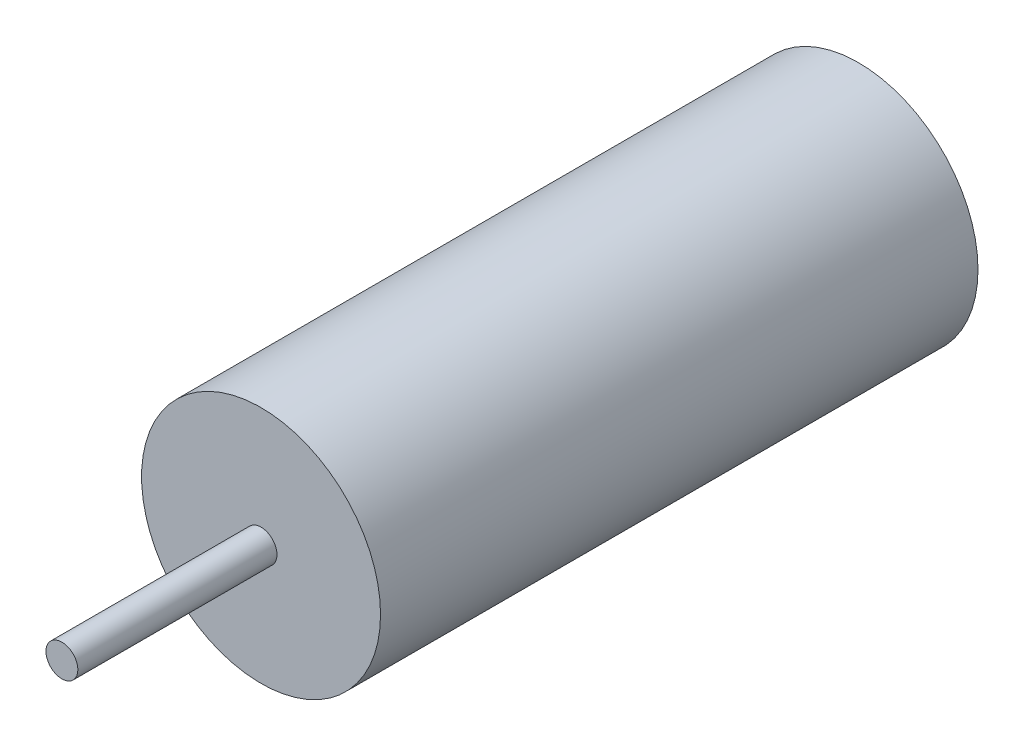
ISO-10303-21;
HEADER;
FILE_DESCRIPTION(('STEP AP214'),'2;1');
FILE_NAME('part.step','',(''),(''),'','','');
FILE_SCHEMA(('AUTOMOTIVE_DESIGN { 1 0 10303 214 1 1 1 1 }'));
ENDSEC;
DATA;
#1=APPLICATION_CONTEXT('core data for automotive mechanical design processes');
#2=APPLICATION_PROTOCOL_DEFINITION('international standard','automotive_design',2000,#1);
#3=PRODUCT_CONTEXT('',#1,'mechanical');
#4=PRODUCT('Part','Part','',(#3));
#5=PRODUCT_RELATED_PRODUCT_CATEGORY('part','',(#4));
#6=PRODUCT_DEFINITION_FORMATION('','',#4);
#7=PRODUCT_DEFINITION_CONTEXT('part definition',#1,'design');
#8=PRODUCT_DEFINITION('design','',#6,#7);
#9=PRODUCT_DEFINITION_SHAPE('','',#8);
#10=(LENGTH_UNIT() NAMED_UNIT(*) SI_UNIT(.MILLI.,.METRE.));
#11=(NAMED_UNIT(*) PLANE_ANGLE_UNIT() SI_UNIT($,.RADIAN.));
#12=(NAMED_UNIT(*) SI_UNIT($,.STERADIAN.) SOLID_ANGLE_UNIT());
#13=UNCERTAINTY_MEASURE_WITH_UNIT(LENGTH_MEASURE(1.E-05),#10,'distance_accuracy_value','');
#14=(GEOMETRIC_REPRESENTATION_CONTEXT(3) GLOBAL_UNCERTAINTY_ASSIGNED_CONTEXT((#13)) GLOBAL_UNIT_ASSIGNED_CONTEXT((#10,
#11,#12)) REPRESENTATION_CONTEXT('',''));
#15=CARTESIAN_POINT('',(0.,0.,0.));
#16=DIRECTION('',(0.,0.,1.));
#17=DIRECTION('',(1.,0.,0.));
#18=AXIS2_PLACEMENT_3D('',#15,#16,#17);
#19=CARTESIAN_POINT('',(0.,0.,15.));
#20=DIRECTION('',(0.,0.,-1.));
#21=DIRECTION('',(-1.,0.,0.));
#22=AXIS2_PLACEMENT_3D('',#19,#20,#21);
#23=CYLINDRICAL_SURFACE('',#22,3.);
#24=CARTESIAN_POINT('',(0.,0.,15.));
#25=DIRECTION('',(0.,0.,1.));
#26=DIRECTION('',(1.,0.,0.));
#27=AXIS2_PLACEMENT_3D('',#24,#25,#26);
#28=CIRCLE('',#27,3.);
#29=CARTESIAN_POINT('',(3.,0.,15.));
#30=VERTEX_POINT('',#29);
#31=EDGE_CURVE('E10',#30,#30,#28,.T.);
#32=ORIENTED_EDGE('',*,*,#31,.F.);
#33=EDGE_LOOP('',(#32));
#34=FACE_BOUND('',#33,.T.);
#35=CARTESIAN_POINT('',(0.,0.,0.));
#36=DIRECTION('',(0.,0.,1.));
#37=DIRECTION('',(1.,0.,0.));
#38=AXIS2_PLACEMENT_3D('',#35,#36,#37);
#39=CIRCLE('',#38,3.);
#40=CARTESIAN_POINT('',(3.,0.,0.));
#41=VERTEX_POINT('',#40);
#42=EDGE_CURVE('E40',#41,#41,#39,.T.);
#43=ORIENTED_EDGE('',*,*,#42,.T.);
#44=EDGE_LOOP('',(#43));
#45=FACE_BOUND('',#44,.T.);
#46=ADVANCED_FACE('F37',(#34,#45),#23,.T.);
#47=CARTESIAN_POINT('',(0.,0.,15.));
#48=DIRECTION('',(0.,0.,1.));
#49=DIRECTION('',(1.,0.,0.));
#50=AXIS2_PLACEMENT_3D('',#47,#48,#49);
#51=PLANE('',#50);
#52=CARTESIAN_POINT('',(0.,0.,15.));
#53=DIRECTION('',(0.,0.,1.));
#54=DIRECTION('',(1.,0.,0.));
#55=AXIS2_PLACEMENT_3D('',#52,#53,#54);
#56=CIRCLE('',#55,0.4);
#57=CARTESIAN_POINT('',(0.4,0.,15.));
#58=VERTEX_POINT('',#57);
#59=EDGE_CURVE('E49',#58,#58,#56,.T.);
#60=ORIENTED_EDGE('',*,*,#59,.F.);
#61=EDGE_LOOP('',(#60));
#62=FACE_BOUND('',#61,.T.);
#63=ORIENTED_EDGE('',*,*,#31,.T.);
#64=EDGE_LOOP('',(#63));
#65=FACE_BOUND('',#64,.T.);
#66=ADVANCED_FACE('F64',(#62,#65),#51,.T.);
#67=CARTESIAN_POINT('',(0.,0.,0.));
#68=DIRECTION('',(0.,0.,1.));
#69=DIRECTION('',(1.,0.,0.));
#70=AXIS2_PLACEMENT_3D('',#67,#68,#69);
#71=PLANE('',#70);
#72=ORIENTED_EDGE('',*,*,#42,.F.);
#73=EDGE_LOOP('',(#72));
#74=FACE_BOUND('',#73,.T.);
#75=ADVANCED_FACE('F60',(#74),#71,.F.);
#76=CARTESIAN_POINT('',(0.,0.,20.));
#77=DIRECTION('',(0.,0.,-1.));
#78=DIRECTION('',(-1.,0.,0.));
#79=AXIS2_PLACEMENT_3D('',#76,#77,#78);
#80=CYLINDRICAL_SURFACE('',#79,0.4);
#81=CARTESIAN_POINT('',(0.,0.,20.));
#82=DIRECTION('',(0.,0.,1.));
#83=DIRECTION('',(1.,0.,0.));
#84=AXIS2_PLACEMENT_3D('',#81,#82,#83);
#85=CIRCLE('',#84,0.4);
#86=CARTESIAN_POINT('',(0.4,0.,20.));
#87=VERTEX_POINT('',#86);
#88=EDGE_CURVE('E47',#87,#87,#85,.T.);
#89=ORIENTED_EDGE('',*,*,#88,.F.);
#90=EDGE_LOOP('',(#89));
#91=FACE_BOUND('',#90,.T.);
#92=ORIENTED_EDGE('',*,*,#59,.T.);
#93=EDGE_LOOP('',(#92));
#94=FACE_BOUND('',#93,.T.);
#95=ADVANCED_FACE('F57',(#91,#94),#80,.T.);
#96=CARTESIAN_POINT('',(0.,0.,20.));
#97=DIRECTION('',(0.,0.,1.));
#98=DIRECTION('',(1.,0.,0.));
#99=AXIS2_PLACEMENT_3D('',#96,#97,#98);
#100=PLANE('',#99);
#101=ORIENTED_EDGE('',*,*,#88,.T.);
#102=EDGE_LOOP('',(#101));
#103=FACE_BOUND('',#102,.T.);
#104=ADVANCED_FACE('F55',(#103),#100,.T.);
#105=CLOSED_SHELL('',(#46,#66,#75,#95,#104));
#106=MANIFOLD_SOLID_BREP('B2',#105);
#107=ADVANCED_BREP_SHAPE_REPRESENTATION('',(#18,#106),#14);
#108=SHAPE_DEFINITION_REPRESENTATION(#9,#107);
ENDSEC;
END-ISO-10303-21;
